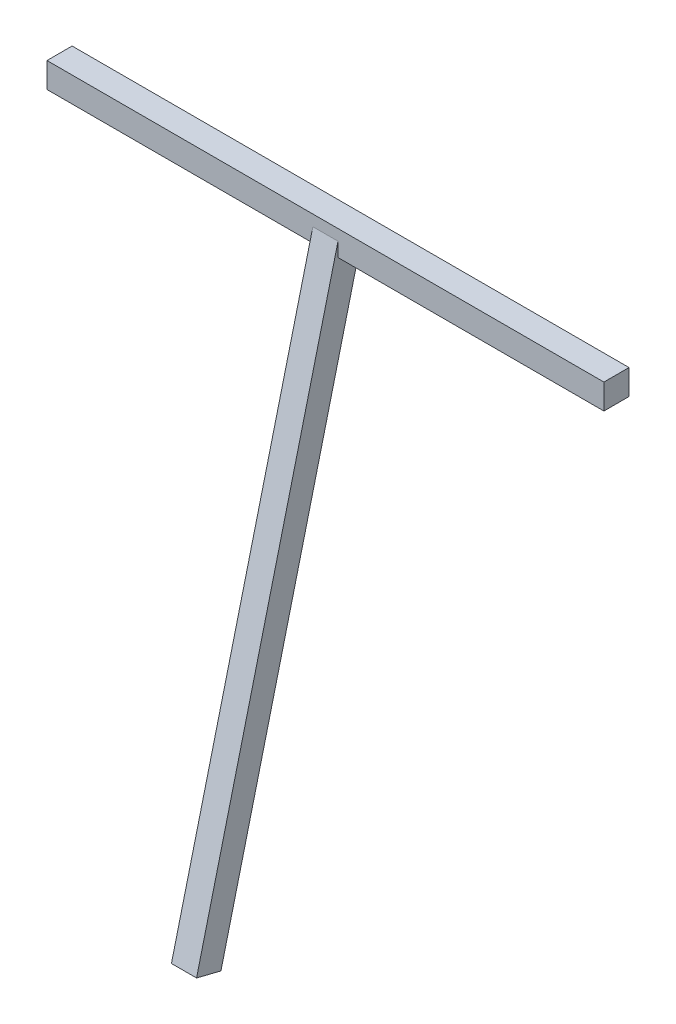
ISO-10303-21;
HEADER;
FILE_DESCRIPTION(('STEP AP214'),'2;1');
FILE_NAME('part.step','',(''),(''),'','','');
FILE_SCHEMA(('AUTOMOTIVE_DESIGN { 1 0 10303 214 1 1 1 1 }'));
ENDSEC;
DATA;
#1=APPLICATION_CONTEXT('core data for automotive mechanical design processes');
#2=APPLICATION_PROTOCOL_DEFINITION('international standard','automotive_design',2000,#1);
#3=PRODUCT_CONTEXT('',#1,'mechanical');
#4=PRODUCT('Part','Part','',(#3));
#5=PRODUCT_RELATED_PRODUCT_CATEGORY('part','',(#4));
#6=PRODUCT_DEFINITION_FORMATION('','',#4);
#7=PRODUCT_DEFINITION_CONTEXT('part definition',#1,'design');
#8=PRODUCT_DEFINITION('design','',#6,#7);
#9=PRODUCT_DEFINITION_SHAPE('','',#8);
#10=(LENGTH_UNIT() NAMED_UNIT(*) SI_UNIT(.MILLI.,.METRE.));
#11=(NAMED_UNIT(*) PLANE_ANGLE_UNIT() SI_UNIT($,.RADIAN.));
#12=(NAMED_UNIT(*) SI_UNIT($,.STERADIAN.) SOLID_ANGLE_UNIT());
#13=UNCERTAINTY_MEASURE_WITH_UNIT(LENGTH_MEASURE(1.E-05),#10,'distance_accuracy_value','');
#14=(GEOMETRIC_REPRESENTATION_CONTEXT(3) GLOBAL_UNCERTAINTY_ASSIGNED_CONTEXT((#13)) GLOBAL_UNIT_ASSIGNED_CONTEXT((#10,
#11,#12)) REPRESENTATION_CONTEXT('',''));
#15=CARTESIAN_POINT('',(0.,0.,0.));
#16=DIRECTION('',(0.,0.,1.));
#17=DIRECTION('',(1.,0.,0.));
#18=AXIS2_PLACEMENT_3D('',#15,#16,#17);
#19=CARTESIAN_POINT('',(-332.5,15.,15.));
#20=DIRECTION('',(0.,0.,1.));
#21=DIRECTION('',(0.,-1.,0.));
#22=AXIS2_PLACEMENT_3D('',#19,#20,#21);
#23=PLANE('',#22);
#24=DIRECTION('',(1.,0.,0.));
#25=VECTOR('',#24,1.);
#26=CARTESIAN_POINT('',(-332.5,1.8417684135434,15.));
#27=LINE('',#26,#25);
#28=CARTESIAN_POINT('',(-15.,1.84176841354233,15.0000000000002));
#29=VERTEX_POINT('',#28);
#30=CARTESIAN_POINT('',(15.,1.84176841354333,15.));
#31=VERTEX_POINT('',#30);
#32=EDGE_CURVE('E11',#29,#31,#27,.T.);
#33=ORIENTED_EDGE('',*,*,#32,.T.);
#34=DIRECTION('',(0.,-1.,0.));
#35=VECTOR('',#34,1.);
#36=CARTESIAN_POINT('',(15.,15.,15.));
#37=LINE('',#36,#35);
#38=CARTESIAN_POINT('',(15.,-15.,15.));
#39=VERTEX_POINT('',#38);
#40=EDGE_CURVE('E126',#31,#39,#37,.T.);
#41=ORIENTED_EDGE('',*,*,#40,.T.);
#42=DIRECTION('',(1.,0.,0.));
#43=VECTOR('',#42,1.);
#44=CARTESIAN_POINT('',(-332.5,-15.,15.));
#45=LINE('',#44,#43);
#46=CARTESIAN_POINT('',(332.5,-15.,15.));
#47=VERTEX_POINT('',#46);
#48=EDGE_CURVE('E158',#39,#47,#45,.T.);
#49=ORIENTED_EDGE('',*,*,#48,.T.);
#50=DIRECTION('',(0.,-1.,0.));
#51=VECTOR('',#50,1.);
#52=CARTESIAN_POINT('',(332.5,15.,15.));
#53=LINE('',#52,#51);
#54=CARTESIAN_POINT('',(332.5,15.,15.));
#55=VERTEX_POINT('',#54);
#56=EDGE_CURVE('E135',#55,#47,#53,.T.);
#57=ORIENTED_EDGE('',*,*,#56,.F.);
#58=DIRECTION('',(1.,0.,0.));
#59=VECTOR('',#58,1.);
#60=CARTESIAN_POINT('',(-332.5,15.,15.));
#61=LINE('',#60,#59);
#62=CARTESIAN_POINT('',(-332.5,15.,15.));
#63=VERTEX_POINT('',#62);
#64=EDGE_CURVE('E55',#63,#55,#61,.T.);
#65=ORIENTED_EDGE('',*,*,#64,.F.);
#66=DIRECTION('',(0.,-1.,0.));
#67=VECTOR('',#66,1.);
#68=CARTESIAN_POINT('',(-332.5,15.,15.));
#69=LINE('',#68,#67);
#70=CARTESIAN_POINT('',(-332.5,-15.,15.));
#71=VERTEX_POINT('',#70);
#72=EDGE_CURVE('E147',#63,#71,#69,.T.);
#73=ORIENTED_EDGE('',*,*,#72,.T.);
#74=CARTESIAN_POINT('',(-15.,-15.,15.));
#75=VERTEX_POINT('',#74);
#76=EDGE_CURVE('E165',#71,#75,#45,.T.);
#77=ORIENTED_EDGE('',*,*,#76,.T.);
#78=DIRECTION('',(0.,1.,0.));
#79=VECTOR('',#78,1.);
#80=CARTESIAN_POINT('',(-15.,15.,15.));
#81=LINE('',#80,#79);
#82=EDGE_CURVE('E127',#75,#29,#81,.T.);
#83=ORIENTED_EDGE('',*,*,#82,.T.);
#84=EDGE_LOOP('',(#33,#41,#49,#57,#65,#73,#77,#83));
#85=FACE_BOUND('',#84,.T.);
#86=ADVANCED_FACE('F33',(#85),#23,.T.);
#87=CARTESIAN_POINT('',(-332.5,-15.,-15.));
#88=DIRECTION('',(0.,-1.,0.));
#89=DIRECTION('',(0.,0.,-1.));
#90=AXIS2_PLACEMENT_3D('',#87,#88,#89);
#91=PLANE('',#90);
#92=ORIENTED_EDGE('',*,*,#48,.F.);
#93=DIRECTION('',(0.,0.,-1.));
#94=VECTOR('',#93,1.);
#95=CARTESIAN_POINT('',(15.,-15.,-15.));
#96=LINE('',#95,#94);
#97=CARTESIAN_POINT('',(15.,-15.0000000000002,-11.7192843976007));
#98=VERTEX_POINT('',#97);
#99=EDGE_CURVE('E40',#39,#98,#96,.T.);
#100=ORIENTED_EDGE('',*,*,#99,.T.);
#101=DIRECTION('',(-1.,0.,0.));
#102=VECTOR('',#101,1.);
#103=CARTESIAN_POINT('',(-332.5,-15.,-11.7192843976008));
#104=LINE('',#103,#102);
#105=CARTESIAN_POINT('',(-15.,-15.,-11.7192843976007));
#106=VERTEX_POINT('',#105);
#107=EDGE_CURVE('E160',#98,#106,#104,.T.);
#108=ORIENTED_EDGE('',*,*,#107,.T.);
#109=DIRECTION('',(0.,0.,1.));
#110=VECTOR('',#109,1.);
#111=CARTESIAN_POINT('',(-15.,-15.,-15.));
#112=LINE('',#111,#110);
#113=EDGE_CURVE('E170',#106,#75,#112,.T.);
#114=ORIENTED_EDGE('',*,*,#113,.T.);
#115=ORIENTED_EDGE('',*,*,#76,.F.);
#116=DIRECTION('',(0.,0.,-1.));
#117=VECTOR('',#116,1.);
#118=CARTESIAN_POINT('',(-332.5,-15.,-15.));
#119=LINE('',#118,#117);
#120=CARTESIAN_POINT('',(-332.5,-15.,-15.));
#121=VERTEX_POINT('',#120);
#122=EDGE_CURVE('E149',#71,#121,#119,.T.);
#123=ORIENTED_EDGE('',*,*,#122,.T.);
#124=DIRECTION('',(1.,0.,0.));
#125=VECTOR('',#124,1.);
#126=CARTESIAN_POINT('',(-332.5,-15.,-15.));
#127=LINE('',#126,#125);
#128=CARTESIAN_POINT('',(332.5,-15.,-15.));
#129=VERTEX_POINT('',#128);
#130=EDGE_CURVE('E163',#121,#129,#127,.T.);
#131=ORIENTED_EDGE('',*,*,#130,.T.);
#132=DIRECTION('',(0.,0.,-1.));
#133=VECTOR('',#132,1.);
#134=CARTESIAN_POINT('',(332.5,-15.,-15.));
#135=LINE('',#134,#133);
#136=EDGE_CURVE('E138',#47,#129,#135,.T.);
#137=ORIENTED_EDGE('',*,*,#136,.F.);
#138=EDGE_LOOP('',(#92,#100,#108,#114,#115,#123,#131,#137));
#139=FACE_BOUND('',#138,.T.);
#140=ADVANCED_FACE('F175',(#139),#91,.T.);
#141=CARTESIAN_POINT('',(-332.5,15.,-15.));
#142=DIRECTION('',(0.,1.,0.));
#143=DIRECTION('',(0.,0.,1.));
#144=AXIS2_PLACEMENT_3D('',#141,#142,#143);
#145=PLANE('',#144);
#146=ORIENTED_EDGE('',*,*,#64,.T.);
#147=DIRECTION('',(0.,0.,1.));
#148=VECTOR('',#147,1.);
#149=CARTESIAN_POINT('',(332.5,15.,-15.));
#150=LINE('',#149,#148);
#151=CARTESIAN_POINT('',(332.5,15.,-15.));
#152=VERTEX_POINT('',#151);
#153=EDGE_CURVE('E144',#152,#55,#150,.T.);
#154=ORIENTED_EDGE('',*,*,#153,.F.);
#155=DIRECTION('',(1.,0.,0.));
#156=VECTOR('',#155,1.);
#157=CARTESIAN_POINT('',(-332.5,15.,-15.));
#158=LINE('',#157,#156);
#159=CARTESIAN_POINT('',(-332.5,15.,-15.));
#160=VERTEX_POINT('',#159);
#161=EDGE_CURVE('E161',#160,#152,#158,.T.);
#162=ORIENTED_EDGE('',*,*,#161,.F.);
#163=DIRECTION('',(0.,0.,1.));
#164=VECTOR('',#163,1.);
#165=CARTESIAN_POINT('',(-332.5,15.,-15.));
#166=LINE('',#165,#164);
#167=EDGE_CURVE('E155',#160,#63,#166,.T.);
#168=ORIENTED_EDGE('',*,*,#167,.T.);
#169=EDGE_LOOP('',(#146,#154,#162,#168));
#170=FACE_BOUND('',#169,.T.);
#171=ADVANCED_FACE('F196',(#170),#145,.T.);
#172=CARTESIAN_POINT('',(-332.5,15.,-15.));
#173=DIRECTION('',(0.,0.,-1.));
#174=DIRECTION('',(0.,1.,0.));
#175=AXIS2_PLACEMENT_3D('',#172,#173,#174);
#176=PLANE('',#175);
#177=ORIENTED_EDGE('',*,*,#161,.T.);
#178=DIRECTION('',(0.,1.,0.));
#179=VECTOR('',#178,1.);
#180=CARTESIAN_POINT('',(332.5,15.,-15.));
#181=LINE('',#180,#179);
#182=EDGE_CURVE('E141',#129,#152,#181,.T.);
#183=ORIENTED_EDGE('',*,*,#182,.F.);
#184=ORIENTED_EDGE('',*,*,#130,.F.);
#185=DIRECTION('',(0.,1.,0.));
#186=VECTOR('',#185,1.);
#187=CARTESIAN_POINT('',(-332.5,15.,-15.));
#188=LINE('',#187,#186);
#189=EDGE_CURVE('E152',#121,#160,#188,.T.);
#190=ORIENTED_EDGE('',*,*,#189,.T.);
#191=EDGE_LOOP('',(#177,#183,#184,#190));
#192=FACE_BOUND('',#191,.T.);
#193=ADVANCED_FACE('F200',(#192),#176,.T.);
#194=CARTESIAN_POINT('',(-332.5,0.,0.));
#195=DIRECTION('',(-1.,0.,0.));
#196=DIRECTION('',(0.,0.,1.));
#197=AXIS2_PLACEMENT_3D('',#194,#195,#196);
#198=PLANE('',#197);
#199=ORIENTED_EDGE('',*,*,#72,.F.);
#200=ORIENTED_EDGE('',*,*,#167,.F.);
#201=ORIENTED_EDGE('',*,*,#189,.F.);
#202=ORIENTED_EDGE('',*,*,#122,.F.);
#203=EDGE_LOOP('',(#199,#200,#201,#202));
#204=FACE_BOUND('',#203,.T.);
#205=ADVANCED_FACE('F205',(#204),#198,.T.);
#206=CARTESIAN_POINT('',(332.5,0.,0.));
#207=DIRECTION('',(-1.,0.,0.));
#208=DIRECTION('',(0.,0.,1.));
#209=AXIS2_PLACEMENT_3D('',#206,#207,#208);
#210=PLANE('',#209);
#211=ORIENTED_EDGE('',*,*,#56,.T.);
#212=ORIENTED_EDGE('',*,*,#136,.T.);
#213=ORIENTED_EDGE('',*,*,#182,.T.);
#214=ORIENTED_EDGE('',*,*,#153,.T.);
#215=EDGE_LOOP('',(#211,#212,#213,#214));
#216=FACE_BOUND('',#215,.T.);
#217=ADVANCED_FACE('F210',(#216),#210,.F.);
#218=CARTESIAN_POINT('',(15.,-675.578179959202,183.899762813908));
#219=DIRECTION('',(-1.,0.,0.));
#220=DIRECTION('',(0.,0.,1.));
#221=AXIS2_PLACEMENT_3D('',#218,#219,#220);
#222=PLANE('',#221);
#223=ORIENTED_EDGE('',*,*,#40,.F.);
#224=DIRECTION('',(0.,0.970295726275996,-0.241921895599668));
#225=VECTOR('',#224,1.);
#226=CARTESIAN_POINT('',(15.,-675.578179959202,183.899762813908));
#227=LINE('',#226,#225);
#228=CARTESIAN_POINT('',(15.,-675.578179959202,183.899762813908));
#229=VERTEX_POINT('',#228);
#230=EDGE_CURVE('E109',#229,#31,#227,.T.);
#231=ORIENTED_EDGE('',*,*,#230,.F.);
#232=DIRECTION('',(0.,0.241921895599668,0.970295726275996));
#233=VECTOR('',#232,1.);
#234=CARTESIAN_POINT('',(15.,-675.578179959202,183.899762813908));
#235=LINE('',#234,#233);
#236=CARTESIAN_POINT('',(15.,-682.835836827192,154.790891025628));
#237=VERTEX_POINT('',#236);
#238=EDGE_CURVE('E115',#237,#229,#235,.T.);
#239=ORIENTED_EDGE('',*,*,#238,.F.);
#240=DIRECTION('',(0.,0.970295726275996,-0.241921895599668));
#241=VECTOR('',#240,1.);
#242=CARTESIAN_POINT('',(15.,-682.835836827192,154.790891025628));
#243=LINE('',#242,#241);
#244=EDGE_CURVE('E177',#237,#98,#243,.T.);
#245=ORIENTED_EDGE('',*,*,#244,.T.);
#246=ORIENTED_EDGE('',*,*,#99,.F.);
#247=EDGE_LOOP('',(#223,#231,#239,#245,#246));
#248=FACE_BOUND('',#247,.T.);
#249=ADVANCED_FACE('F124',(#248),#222,.F.);
#250=CARTESIAN_POINT('',(-15.,-675.578179959202,183.899762813908));
#251=DIRECTION('',(0.,-0.241921895599668,-0.970295726275996));
#252=DIRECTION('',(0.,0.970295726275996,-0.241921895599668));
#253=AXIS2_PLACEMENT_3D('',#250,#251,#252);
#254=PLANE('',#253);
#255=ORIENTED_EDGE('',*,*,#32,.F.);
#256=DIRECTION('',(0.,0.970295726275996,-0.241921895599668));
#257=VECTOR('',#256,1.);
#258=CARTESIAN_POINT('',(-15.,-675.578179959202,183.899762813908));
#259=LINE('',#258,#257);
#260=CARTESIAN_POINT('',(-15.,-675.578179959202,183.899762813908));
#261=VERTEX_POINT('',#260);
#262=EDGE_CURVE('E111',#261,#29,#259,.T.);
#263=ORIENTED_EDGE('',*,*,#262,.F.);
#264=DIRECTION('',(-1.,0.,0.));
#265=VECTOR('',#264,1.);
#266=CARTESIAN_POINT('',(-15.,-675.578179959202,183.899762813908));
#267=LINE('',#266,#265);
#268=EDGE_CURVE('E105',#229,#261,#267,.T.);
#269=ORIENTED_EDGE('',*,*,#268,.F.);
#270=ORIENTED_EDGE('',*,*,#230,.T.);
#271=EDGE_LOOP('',(#255,#263,#269,#270));
#272=FACE_BOUND('',#271,.T.);
#273=ADVANCED_FACE('F107',(#272),#254,.F.);
#274=CARTESIAN_POINT('',(-15.,-675.578179959202,183.899762813908));
#275=DIRECTION('',(1.,0.,0.));
#276=DIRECTION('',(0.,0.,-1.));
#277=AXIS2_PLACEMENT_3D('',#274,#275,#276);
#278=PLANE('',#277);
#279=ORIENTED_EDGE('',*,*,#82,.F.);
#280=ORIENTED_EDGE('',*,*,#113,.F.);
#281=DIRECTION('',(0.,0.970295726275996,-0.241921895599668));
#282=VECTOR('',#281,1.);
#283=CARTESIAN_POINT('',(-15.,-682.835836827192,154.790891025628));
#284=LINE('',#283,#282);
#285=CARTESIAN_POINT('',(-15.,-682.835836827192,154.790891025628));
#286=VERTEX_POINT('',#285);
#287=EDGE_CURVE('E47',#286,#106,#284,.T.);
#288=ORIENTED_EDGE('',*,*,#287,.F.);
#289=DIRECTION('',(0.,-0.241921895599668,-0.970295726275996));
#290=VECTOR('',#289,1.);
#291=CARTESIAN_POINT('',(-15.,-675.578179959202,183.899762813908));
#292=LINE('',#291,#290);
#293=EDGE_CURVE('E114',#261,#286,#292,.T.);
#294=ORIENTED_EDGE('',*,*,#293,.F.);
#295=ORIENTED_EDGE('',*,*,#262,.T.);
#296=EDGE_LOOP('',(#279,#280,#288,#294,#295));
#297=FACE_BOUND('',#296,.T.);
#298=ADVANCED_FACE('F179',(#297),#278,.F.);
#299=CARTESIAN_POINT('',(-15.,-682.835836827192,154.790891025628));
#300=DIRECTION('',(0.,0.241921895599668,0.970295726275996));
#301=DIRECTION('',(0.,-0.970295726275996,0.241921895599668));
#302=AXIS2_PLACEMENT_3D('',#299,#300,#301);
#303=PLANE('',#302);
#304=ORIENTED_EDGE('',*,*,#107,.F.);
#305=ORIENTED_EDGE('',*,*,#244,.F.);
#306=DIRECTION('',(1.,0.,0.));
#307=VECTOR('',#306,1.);
#308=CARTESIAN_POINT('',(-15.,-682.835836827192,154.790891025628));
#309=LINE('',#308,#307);
#310=EDGE_CURVE('E119',#286,#237,#309,.T.);
#311=ORIENTED_EDGE('',*,*,#310,.F.);
#312=ORIENTED_EDGE('',*,*,#287,.T.);
#313=EDGE_LOOP('',(#304,#305,#311,#312));
#314=FACE_BOUND('',#313,.T.);
#315=ADVANCED_FACE('F183',(#314),#303,.F.);
#316=CARTESIAN_POINT('',(0.,-679.207008393197,169.345326919768));
#317=DIRECTION('',(0.,-0.970295726275996,0.241921895599668));
#318=DIRECTION('',(0.,-0.241921895599668,-0.970295726275996));
#319=AXIS2_PLACEMENT_3D('',#316,#317,#318);
#320=PLANE('',#319);
#321=ORIENTED_EDGE('',*,*,#238,.T.);
#322=ORIENTED_EDGE('',*,*,#268,.T.);
#323=ORIENTED_EDGE('',*,*,#293,.T.);
#324=ORIENTED_EDGE('',*,*,#310,.T.);
#325=EDGE_LOOP('',(#321,#322,#323,#324));
#326=FACE_BOUND('',#325,.T.);
#327=ADVANCED_FACE('F118',(#326),#320,.T.);
#328=CLOSED_SHELL('',(#86,#140,#171,#193,#205,#217,#249,#273,#298,#315,#327));
#329=MANIFOLD_SOLID_BREP('B2',#328);
#330=ADVANCED_BREP_SHAPE_REPRESENTATION('',(#18,#329),#14);
#331=SHAPE_DEFINITION_REPRESENTATION(#9,#330);
ENDSEC;
END-ISO-10303-21;
